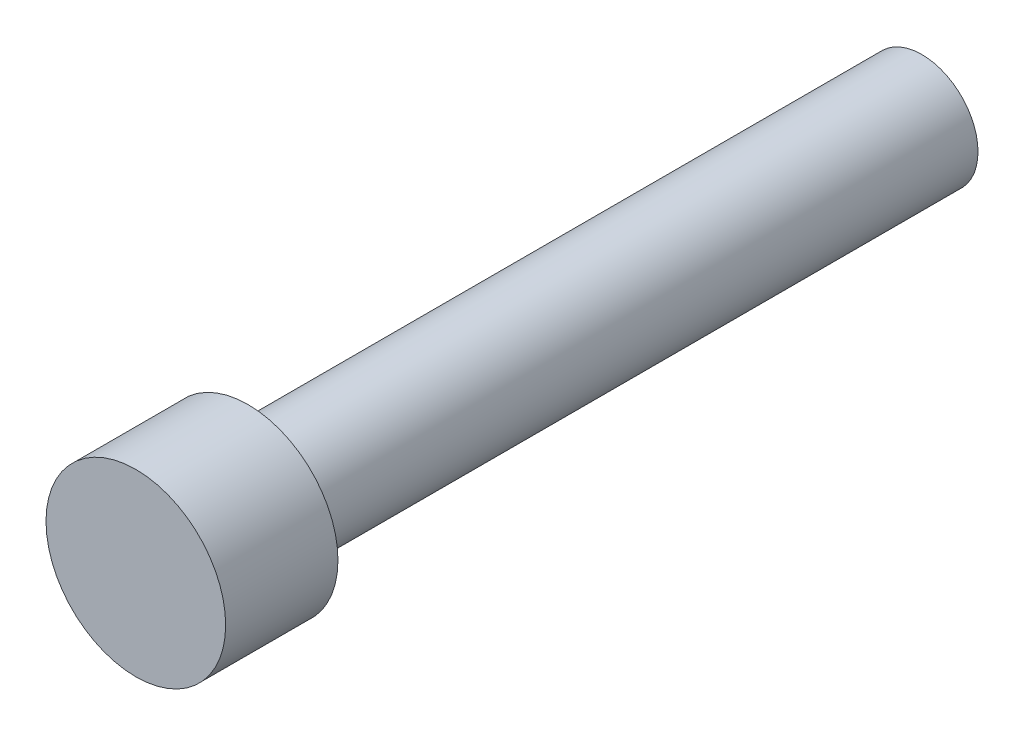
ISO-10303-21;
HEADER;
FILE_DESCRIPTION(('STEP AP214'),'2;1');
FILE_NAME('part.step','',(''),(''),'','','');
FILE_SCHEMA(('AUTOMOTIVE_DESIGN { 1 0 10303 214 1 1 1 1 }'));
ENDSEC;
DATA;
#1=APPLICATION_CONTEXT('core data for automotive mechanical design processes');
#2=APPLICATION_PROTOCOL_DEFINITION('international standard','automotive_design',2000,#1);
#3=PRODUCT_CONTEXT('',#1,'mechanical');
#4=PRODUCT('Part','Part','',(#3));
#5=PRODUCT_RELATED_PRODUCT_CATEGORY('part','',(#4));
#6=PRODUCT_DEFINITION_FORMATION('','',#4);
#7=PRODUCT_DEFINITION_CONTEXT('part definition',#1,'design');
#8=PRODUCT_DEFINITION('design','',#6,#7);
#9=PRODUCT_DEFINITION_SHAPE('','',#8);
#10=(LENGTH_UNIT() NAMED_UNIT(*) SI_UNIT(.MILLI.,.METRE.));
#11=(NAMED_UNIT(*) PLANE_ANGLE_UNIT() SI_UNIT($,.RADIAN.));
#12=(NAMED_UNIT(*) SI_UNIT($,.STERADIAN.) SOLID_ANGLE_UNIT());
#13=UNCERTAINTY_MEASURE_WITH_UNIT(LENGTH_MEASURE(1.E-05),#10,'distance_accuracy_value','');
#14=(GEOMETRIC_REPRESENTATION_CONTEXT(3) GLOBAL_UNCERTAINTY_ASSIGNED_CONTEXT((#13)) GLOBAL_UNIT_ASSIGNED_CONTEXT((#10,
#11,#12)) REPRESENTATION_CONTEXT('',''));
#15=CARTESIAN_POINT('',(0.,0.,0.));
#16=DIRECTION('',(0.,0.,1.));
#17=DIRECTION('',(1.,0.,0.));
#18=AXIS2_PLACEMENT_3D('',#15,#16,#17);
#19=CARTESIAN_POINT('',(0.,0.,30.));
#20=DIRECTION('',(0.,0.,-1.));
#21=DIRECTION('',(-1.,0.,0.));
#22=AXIS2_PLACEMENT_3D('',#19,#20,#21);
#23=CYLINDRICAL_SURFACE('',#22,2.5);
#24=CARTESIAN_POINT('',(0.,0.,30.));
#25=DIRECTION('',(0.,0.,1.));
#26=DIRECTION('',(1.,0.,0.));
#27=AXIS2_PLACEMENT_3D('',#24,#25,#26);
#28=CIRCLE('',#27,2.5);
#29=CARTESIAN_POINT('',(2.5,0.,30.));
#30=VERTEX_POINT('',#29);
#31=EDGE_CURVE('E10',#30,#30,#28,.T.);
#32=ORIENTED_EDGE('',*,*,#31,.F.);
#33=EDGE_LOOP('',(#32));
#34=FACE_BOUND('',#33,.T.);
#35=CARTESIAN_POINT('',(0.,0.,0.));
#36=DIRECTION('',(0.,0.,1.));
#37=DIRECTION('',(1.,0.,0.));
#38=AXIS2_PLACEMENT_3D('',#35,#36,#37);
#39=CIRCLE('',#38,2.5);
#40=CARTESIAN_POINT('',(2.5,0.,0.));
#41=VERTEX_POINT('',#40);
#42=EDGE_CURVE('E33',#41,#41,#39,.T.);
#43=ORIENTED_EDGE('',*,*,#42,.T.);
#44=EDGE_LOOP('',(#43));
#45=FACE_BOUND('',#44,.T.);
#46=ADVANCED_FACE('F30',(#34,#45),#23,.T.);
#47=CARTESIAN_POINT('',(0.,0.,0.));
#48=DIRECTION('',(0.,0.,1.));
#49=DIRECTION('',(1.,0.,0.));
#50=AXIS2_PLACEMENT_3D('',#47,#48,#49);
#51=PLANE('',#50);
#52=ORIENTED_EDGE('',*,*,#42,.F.);
#53=EDGE_LOOP('',(#52));
#54=FACE_BOUND('',#53,.T.);
#55=ADVANCED_FACE('F53',(#54),#51,.F.);
#56=CARTESIAN_POINT('',(0.,0.,35.));
#57=DIRECTION('',(0.,0.,-1.));
#58=DIRECTION('',(-1.,0.,0.));
#59=AXIS2_PLACEMENT_3D('',#56,#57,#58);
#60=CYLINDRICAL_SURFACE('',#59,4.);
#61=CARTESIAN_POINT('',(0.,0.,35.));
#62=DIRECTION('',(0.,0.,1.));
#63=DIRECTION('',(1.,0.,0.));
#64=AXIS2_PLACEMENT_3D('',#61,#62,#63);
#65=CIRCLE('',#64,4.);
#66=CARTESIAN_POINT('',(4.,0.,35.));
#67=VERTEX_POINT('',#66);
#68=EDGE_CURVE('E40',#67,#67,#65,.T.);
#69=ORIENTED_EDGE('',*,*,#68,.F.);
#70=EDGE_LOOP('',(#69));
#71=FACE_BOUND('',#70,.T.);
#72=CARTESIAN_POINT('',(0.,0.,30.));
#73=DIRECTION('',(0.,0.,1.));
#74=DIRECTION('',(1.,0.,0.));
#75=AXIS2_PLACEMENT_3D('',#72,#73,#74);
#76=CIRCLE('',#75,4.);
#77=CARTESIAN_POINT('',(4.,0.,30.));
#78=VERTEX_POINT('',#77);
#79=EDGE_CURVE('E42',#78,#78,#76,.T.);
#80=ORIENTED_EDGE('',*,*,#79,.T.);
#81=EDGE_LOOP('',(#80));
#82=FACE_BOUND('',#81,.T.);
#83=ADVANCED_FACE('F50',(#71,#82),#60,.T.);
#84=CARTESIAN_POINT('',(0.,0.,35.));
#85=DIRECTION('',(0.,0.,1.));
#86=DIRECTION('',(1.,0.,0.));
#87=AXIS2_PLACEMENT_3D('',#84,#85,#86);
#88=PLANE('',#87);
#89=ORIENTED_EDGE('',*,*,#68,.T.);
#90=EDGE_LOOP('',(#89));
#91=FACE_BOUND('',#90,.T.);
#92=ADVANCED_FACE('F48',(#91),#88,.T.);
#93=CARTESIAN_POINT('',(0.,0.,30.));
#94=DIRECTION('',(0.,0.,1.));
#95=DIRECTION('',(1.,0.,0.));
#96=AXIS2_PLACEMENT_3D('',#93,#94,#95);
#97=PLANE('',#96);
#98=ORIENTED_EDGE('',*,*,#31,.T.);
#99=EDGE_LOOP('',(#98));
#100=FACE_BOUND('',#99,.T.);
#101=ORIENTED_EDGE('',*,*,#79,.F.);
#102=EDGE_LOOP('',(#101));
#103=FACE_BOUND('',#102,.T.);
#104=ADVANCED_FACE('F57',(#100,#103),#97,.F.);
#105=CLOSED_SHELL('',(#46,#55,#83,#92,#104));
#106=MANIFOLD_SOLID_BREP('B2',#105);
#107=ADVANCED_BREP_SHAPE_REPRESENTATION('',(#18,#106),#14);
#108=SHAPE_DEFINITION_REPRESENTATION(#9,#107);
ENDSEC;
END-ISO-10303-21;
